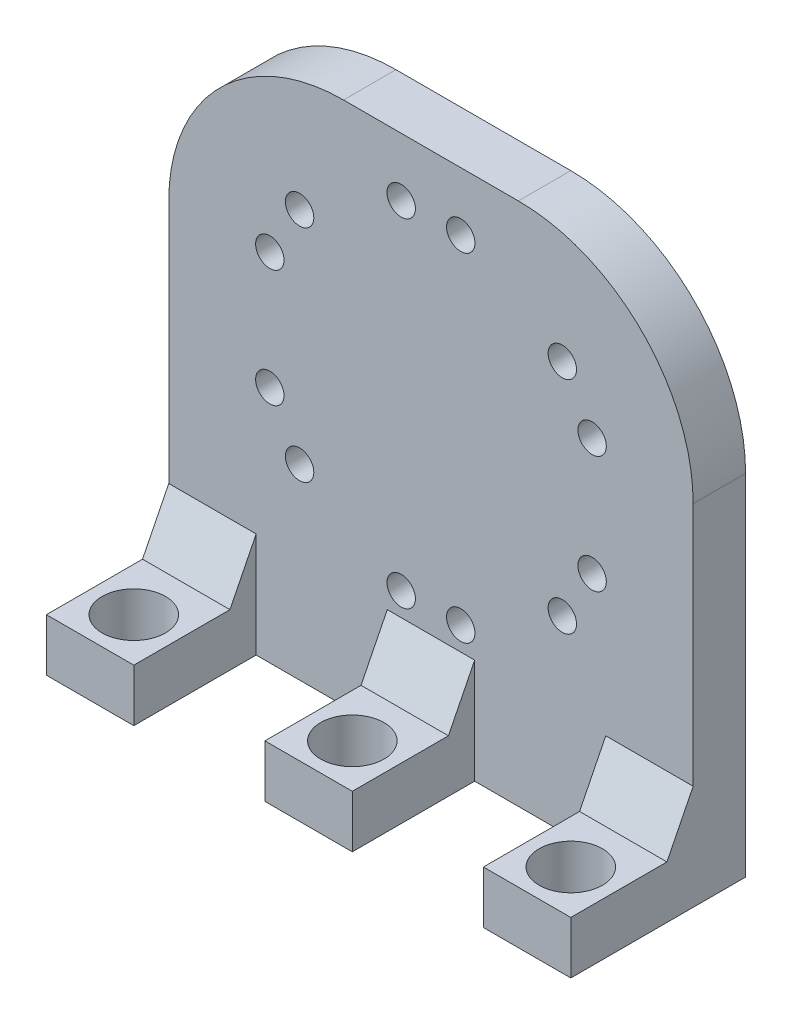
ISO-10303-21;
HEADER;
FILE_DESCRIPTION(('STEP AP214'),'2;1');
FILE_NAME('part.step','',(''),(''),'','','');
FILE_SCHEMA(('AUTOMOTIVE_DESIGN { 1 0 10303 214 1 1 1 1 }'));
ENDSEC;
DATA;
#1=APPLICATION_CONTEXT('core data for automotive mechanical design processes');
#2=APPLICATION_PROTOCOL_DEFINITION('international standard','automotive_design',2000,#1);
#3=PRODUCT_CONTEXT('',#1,'mechanical');
#4=PRODUCT('Part','Part','',(#3));
#5=PRODUCT_RELATED_PRODUCT_CATEGORY('part','',(#4));
#6=PRODUCT_DEFINITION_FORMATION('','',#4);
#7=PRODUCT_DEFINITION_CONTEXT('part definition',#1,'design');
#8=PRODUCT_DEFINITION('design','',#6,#7);
#9=PRODUCT_DEFINITION_SHAPE('','',#8);
#10=(LENGTH_UNIT() NAMED_UNIT(*) SI_UNIT(.MILLI.,.METRE.));
#11=(NAMED_UNIT(*) PLANE_ANGLE_UNIT() SI_UNIT($,.RADIAN.));
#12=(NAMED_UNIT(*) SI_UNIT($,.STERADIAN.) SOLID_ANGLE_UNIT());
#13=UNCERTAINTY_MEASURE_WITH_UNIT(LENGTH_MEASURE(1.E-05),#10,'distance_accuracy_value','');
#14=(GEOMETRIC_REPRESENTATION_CONTEXT(3) GLOBAL_UNCERTAINTY_ASSIGNED_CONTEXT((#13)) GLOBAL_UNIT_ASSIGNED_CONTEXT((#10,
#11,#12)) REPRESENTATION_CONTEXT('',''));
#15=CARTESIAN_POINT('',(0.,0.,0.));
#16=DIRECTION('',(0.,0.,1.));
#17=DIRECTION('',(1.,0.,0.));
#18=AXIS2_PLACEMENT_3D('',#15,#16,#17);
#19=CARTESIAN_POINT('',(0.,0.,6.));
#20=DIRECTION('',(0.,0.,1.));
#21=DIRECTION('',(1.,0.,0.));
#22=AXIS2_PLACEMENT_3D('',#19,#20,#21);
#23=PLANE('',#22);
#24=CARTESIAN_POINT('',(-3.40697724582519,-15.3219281140995,6.));
#25=DIRECTION('',(0.,0.,1.));
#26=DIRECTION('',(1.,0.,0.));
#27=AXIS2_PLACEMENT_3D('',#24,#25,#26);
#28=CIRCLE('',#27,1.625);
#29=CARTESIAN_POINT('',(-1.78197724582519,-15.3219281140995,6.));
#30=VERTEX_POINT('',#29);
#31=EDGE_CURVE('E797',#30,#30,#28,.T.);
#32=ORIENTED_EDGE('',*,*,#31,.F.);
#33=EDGE_LOOP('',(#32));
#34=FACE_BOUND('',#33,.T.);
#35=CARTESIAN_POINT('',(18.4367692198196,-2.71043521204944,6.));
#36=DIRECTION('',(0.,0.,1.));
#37=DIRECTION('',(1.,0.,0.));
#38=AXIS2_PLACEMENT_3D('',#35,#36,#37);
#39=CIRCLE('',#38,1.625);
#40=CARTESIAN_POINT('',(20.0617692198196,-2.71043521204944,6.));
#41=VERTEX_POINT('',#40);
#42=EDGE_CURVE('E794',#41,#41,#39,.T.);
#43=ORIENTED_EDGE('',*,*,#42,.F.);
#44=EDGE_LOOP('',(#43));
#45=FACE_BOUND('',#44,.T.);
#46=CARTESIAN_POINT('',(15.0297919739945,-8.61149290204977,6.));
#47=DIRECTION('',(0.,0.,1.));
#48=DIRECTION('',(1.,0.,0.));
#49=AXIS2_PLACEMENT_3D('',#46,#47,#48);
#50=CIRCLE('',#49,1.625);
#51=CARTESIAN_POINT('',(16.6547919739944,-8.61149290204977,6.));
#52=VERTEX_POINT('',#51);
#53=EDGE_CURVE('E744',#52,#52,#50,.T.);
#54=ORIENTED_EDGE('',*,*,#53,.F.);
#55=EDGE_LOOP('',(#54));
#56=FACE_BOUND('',#55,.T.);
#57=CARTESIAN_POINT('',(15.0297919739942,16.6114929020501,6.));
#58=DIRECTION('',(0.,0.,1.));
#59=DIRECTION('',(1.,0.,0.));
#60=AXIS2_PLACEMENT_3D('',#57,#58,#59);
#61=CIRCLE('',#60,1.625);
#62=CARTESIAN_POINT('',(16.6547919739942,16.6114929020501,6.));
#63=VERTEX_POINT('',#62);
#64=EDGE_CURVE('E790',#63,#63,#61,.T.);
#65=ORIENTED_EDGE('',*,*,#64,.F.);
#66=EDGE_LOOP('',(#65));
#67=FACE_BOUND('',#66,.T.);
#68=CARTESIAN_POINT('',(18.4367692198194,10.7104352120498,6.));
#69=DIRECTION('',(0.,0.,1.));
#70=DIRECTION('',(1.,0.,0.));
#71=AXIS2_PLACEMENT_3D('',#68,#69,#70);
#72=CIRCLE('',#71,1.625);
#73=CARTESIAN_POINT('',(20.0617692198194,10.7104352120498,6.));
#74=VERTEX_POINT('',#73);
#75=EDGE_CURVE('E787',#74,#74,#72,.T.);
#76=ORIENTED_EDGE('',*,*,#75,.F.);
#77=EDGE_LOOP('',(#76));
#78=FACE_BOUND('',#77,.T.);
#79=CARTESIAN_POINT('',(-15.0297919739944,16.6114929020499,6.));
#80=DIRECTION('',(0.,0.,1.));
#81=DIRECTION('',(1.,0.,0.));
#82=AXIS2_PLACEMENT_3D('',#79,#80,#81);
#83=CIRCLE('',#82,1.625);
#84=CARTESIAN_POINT('',(-13.4047919739944,16.6114929020499,6.));
#85=VERTEX_POINT('',#84);
#86=EDGE_CURVE('E784',#85,#85,#83,.T.);
#87=ORIENTED_EDGE('',*,*,#86,.F.);
#88=EDGE_LOOP('',(#87));
#89=FACE_BOUND('',#88,.T.);
#90=CARTESIAN_POINT('',(-15.0297919739943,-8.61149290204997,6.));
#91=DIRECTION('',(0.,0.,1.));
#92=DIRECTION('',(1.,0.,0.));
#93=AXIS2_PLACEMENT_3D('',#90,#91,#92);
#94=CIRCLE('',#93,1.625);
#95=CARTESIAN_POINT('',(-13.4047919739943,-8.61149290204997,6.));
#96=VERTEX_POINT('',#95);
#97=EDGE_CURVE('E781',#96,#96,#94,.T.);
#98=ORIENTED_EDGE('',*,*,#97,.F.);
#99=EDGE_LOOP('',(#98));
#100=FACE_BOUND('',#99,.T.);
#101=CARTESIAN_POINT('',(-18.4367692198195,-2.71043521204968,6.));
#102=DIRECTION('',(0.,0.,1.));
#103=DIRECTION('',(1.,0.,0.));
#104=AXIS2_PLACEMENT_3D('',#101,#102,#103);
#105=CIRCLE('',#104,1.625);
#106=CARTESIAN_POINT('',(-16.8117692198195,-2.71043521204968,6.));
#107=VERTEX_POINT('',#106);
#108=EDGE_CURVE('E778',#107,#107,#105,.T.);
#109=ORIENTED_EDGE('',*,*,#108,.F.);
#110=EDGE_LOOP('',(#109));
#111=FACE_BOUND('',#110,.T.);
#112=CARTESIAN_POINT('',(3.40697724582518,-15.3219281140995,6.));
#113=DIRECTION('',(0.,0.,1.));
#114=DIRECTION('',(1.,0.,0.));
#115=AXIS2_PLACEMENT_3D('',#112,#113,#114);
#116=CIRCLE('',#115,1.625);
#117=CARTESIAN_POINT('',(5.03197724582518,-15.3219281140995,6.));
#118=VERTEX_POINT('',#117);
#119=EDGE_CURVE('E773',#118,#118,#116,.T.);
#120=ORIENTED_EDGE('',*,*,#119,.F.);
#121=EDGE_LOOP('',(#120));
#122=FACE_BOUND('',#121,.T.);
#123=CARTESIAN_POINT('',(-18.4367692198195,10.7104352120496,6.));
#124=DIRECTION('',(0.,0.,1.));
#125=DIRECTION('',(1.,0.,0.));
#126=AXIS2_PLACEMENT_3D('',#123,#124,#125);
#127=CIRCLE('',#126,1.625);
#128=CARTESIAN_POINT('',(-16.8117692198195,10.7104352120496,6.));
#129=VERTEX_POINT('',#128);
#130=EDGE_CURVE('E802',#129,#129,#127,.T.);
#131=ORIENTED_EDGE('',*,*,#130,.F.);
#132=EDGE_LOOP('',(#131));
#133=FACE_BOUND('',#132,.T.);
#134=CARTESIAN_POINT('',(3.40697724582519,23.3219281140995,6.));
#135=DIRECTION('',(0.,0.,1.));
#136=DIRECTION('',(1.,0.,0.));
#137=AXIS2_PLACEMENT_3D('',#134,#135,#136);
#138=CIRCLE('',#137,1.625);
#139=CARTESIAN_POINT('',(5.03197724582519,23.3219281140995,6.));
#140=VERTEX_POINT('',#139);
#141=EDGE_CURVE('E808',#140,#140,#138,.T.);
#142=ORIENTED_EDGE('',*,*,#141,.F.);
#143=EDGE_LOOP('',(#142));
#144=FACE_BOUND('',#143,.T.);
#145=CARTESIAN_POINT('',(-3.40697724582518,23.3219281140995,6.));
#146=DIRECTION('',(0.,0.,1.));
#147=DIRECTION('',(1.,0.,0.));
#148=AXIS2_PLACEMENT_3D('',#145,#146,#147);
#149=CIRCLE('',#148,1.625);
#150=CARTESIAN_POINT('',(-1.78197724582518,23.3219281140995,6.));
#151=VERTEX_POINT('',#150);
#152=EDGE_CURVE('E814',#151,#151,#149,.T.);
#153=ORIENTED_EDGE('',*,*,#152,.F.);
#154=EDGE_LOOP('',(#153));
#155=FACE_BOUND('',#154,.T.);
#156=DIRECTION('',(-1.,0.,0.));
#157=VECTOR('',#156,1.);
#158=CARTESIAN_POINT('',(-30.,30.,6.));
#159=LINE('',#158,#157);
#160=CARTESIAN_POINT('',(9.99999999999999,30.,6.));
#161=VERTEX_POINT('',#160);
#162=CARTESIAN_POINT('',(-10.,30.,6.));
#163=VERTEX_POINT('',#162);
#164=EDGE_CURVE('E297',#161,#163,#159,.T.);
#165=ORIENTED_EDGE('',*,*,#164,.T.);
#166=CARTESIAN_POINT('',(-10.,9.99999999999999,6.));
#167=DIRECTION('',(0.,0.,1.));
#168=DIRECTION('',(1.,0.,0.));
#169=AXIS2_PLACEMENT_3D('',#166,#167,#168);
#170=CIRCLE('',#169,20.);
#171=CARTESIAN_POINT('',(-30.,9.99999999999999,6.));
#172=VERTEX_POINT('',#171);
#173=EDGE_CURVE('E43',#163,#172,#170,.T.);
#174=ORIENTED_EDGE('',*,*,#173,.T.);
#175=DIRECTION('',(0.,-1.,0.));
#176=VECTOR('',#175,1.);
#177=CARTESIAN_POINT('',(-30.,30.,6.));
#178=LINE('',#177,#176);
#179=CARTESIAN_POINT('',(-30.,-18.,6.));
#180=VERTEX_POINT('',#179);
#181=EDGE_CURVE('E190',#172,#180,#178,.T.);
#182=ORIENTED_EDGE('',*,*,#181,.T.);
#183=DIRECTION('',(1.,0.,0.));
#184=VECTOR('',#183,1.);
#185=CARTESIAN_POINT('',(-66.7082039324994,-18.,6.));
#186=LINE('',#185,#184);
#187=CARTESIAN_POINT('',(-20.,-18.,6.));
#188=VERTEX_POINT('',#187);
#189=EDGE_CURVE('E184',#180,#188,#186,.T.);
#190=ORIENTED_EDGE('',*,*,#189,.T.);
#191=DIRECTION('',(0.,-1.,0.));
#192=VECTOR('',#191,1.);
#193=CARTESIAN_POINT('',(-20.,-24.,6.));
#194=LINE('',#193,#192);
#195=CARTESIAN_POINT('',(-20.,-30.,6.));
#196=VERTEX_POINT('',#195);
#197=EDGE_CURVE('E169',#188,#196,#194,.T.);
#198=ORIENTED_EDGE('',*,*,#197,.T.);
#199=DIRECTION('',(1.,0.,0.));
#200=VECTOR('',#199,1.);
#201=CARTESIAN_POINT('',(-30.,-30.,6.));
#202=LINE('',#201,#200);
#203=CARTESIAN_POINT('',(-5.,-30.,6.));
#204=VERTEX_POINT('',#203);
#205=EDGE_CURVE('E293',#196,#204,#202,.T.);
#206=ORIENTED_EDGE('',*,*,#205,.T.);
#207=DIRECTION('',(0.,-1.,0.));
#208=VECTOR('',#207,1.);
#209=CARTESIAN_POINT('',(-5.,-24.,6.));
#210=LINE('',#209,#208);
#211=CARTESIAN_POINT('',(-5.,-18.,6.));
#212=VERTEX_POINT('',#211);
#213=EDGE_CURVE('E227',#212,#204,#210,.T.);
#214=ORIENTED_EDGE('',*,*,#213,.F.);
#215=DIRECTION('',(1.,0.,0.));
#216=VECTOR('',#215,1.);
#217=CARTESIAN_POINT('',(-16.7082039324994,-18.,6.));
#218=LINE('',#217,#216);
#219=CARTESIAN_POINT('',(5.,-18.,6.));
#220=VERTEX_POINT('',#219);
#221=EDGE_CURVE('E200',#212,#220,#218,.T.);
#222=ORIENTED_EDGE('',*,*,#221,.T.);
#223=DIRECTION('',(0.,-1.,0.));
#224=VECTOR('',#223,1.);
#225=CARTESIAN_POINT('',(5.,-24.,6.));
#226=LINE('',#225,#224);
#227=CARTESIAN_POINT('',(5.,-30.,6.));
#228=VERTEX_POINT('',#227);
#229=EDGE_CURVE('E218',#220,#228,#226,.T.);
#230=ORIENTED_EDGE('',*,*,#229,.T.);
#231=CARTESIAN_POINT('',(20.,-30.,6.));
#232=VERTEX_POINT('',#231);
#233=EDGE_CURVE('E291',#228,#232,#202,.T.);
#234=ORIENTED_EDGE('',*,*,#233,.T.);
#235=DIRECTION('',(0.,-1.,0.));
#236=VECTOR('',#235,1.);
#237=CARTESIAN_POINT('',(20.,-24.,6.));
#238=LINE('',#237,#236);
#239=CARTESIAN_POINT('',(20.,-18.,6.));
#240=VERTEX_POINT('',#239);
#241=EDGE_CURVE('E267',#240,#232,#238,.T.);
#242=ORIENTED_EDGE('',*,*,#241,.F.);
#243=DIRECTION('',(1.,0.,0.));
#244=VECTOR('',#243,1.);
#245=CARTESIAN_POINT('',(13.2917960675006,-18.,6.));
#246=LINE('',#245,#244);
#247=CARTESIAN_POINT('',(30.,-18.,6.));
#248=VERTEX_POINT('',#247);
#249=EDGE_CURVE('E259',#240,#248,#246,.T.);
#250=ORIENTED_EDGE('',*,*,#249,.T.);
#251=DIRECTION('',(0.,1.,0.));
#252=VECTOR('',#251,1.);
#253=CARTESIAN_POINT('',(30.,30.,6.));
#254=LINE('',#253,#252);
#255=CARTESIAN_POINT('',(30.,9.99999999999999,6.));
#256=VERTEX_POINT('',#255);
#257=EDGE_CURVE('E295',#248,#256,#254,.T.);
#258=ORIENTED_EDGE('',*,*,#257,.T.);
#259=CARTESIAN_POINT('',(9.99999999999999,9.99999999999999,6.));
#260=DIRECTION('',(0.,0.,1.));
#261=DIRECTION('',(1.,0.,0.));
#262=AXIS2_PLACEMENT_3D('',#259,#260,#261);
#263=CIRCLE('',#262,20.);
#264=EDGE_CURVE('E322',#256,#161,#263,.T.);
#265=ORIENTED_EDGE('',*,*,#264,.T.);
#266=EDGE_LOOP('',(#165,#174,#182,#190,#198,#206,#214,#222,#230,#234,#242,#250,#258,#265));
#267=FACE_BOUND('',#266,.T.);
#268=ADVANCED_FACE('F35',(#34,#45,#56,#67,#78,#89,#100,#111,#122,#133,#144,#155,#267),#23,.T.);
#269=CARTESIAN_POINT('',(-30.,30.,6.));
#270=DIRECTION('',(1.,0.,0.));
#271=DIRECTION('',(0.,1.,0.));
#272=AXIS2_PLACEMENT_3D('',#269,#270,#271);
#273=PLANE('',#272);
#274=ORIENTED_EDGE('',*,*,#181,.F.);
#275=DIRECTION('',(0.,0.,-1.));
#276=VECTOR('',#275,1.);
#277=CARTESIAN_POINT('',(-30.,9.99999999999999,6.));
#278=LINE('',#277,#276);
#279=CARTESIAN_POINT('',(-30.,9.99999999999999,0.));
#280=VERTEX_POINT('',#279);
#281=EDGE_CURVE('E311',#172,#280,#278,.T.);
#282=ORIENTED_EDGE('',*,*,#281,.T.);
#283=DIRECTION('',(0.,-1.,0.));
#284=VECTOR('',#283,1.);
#285=CARTESIAN_POINT('',(-30.,30.,0.));
#286=LINE('',#285,#284);
#287=CARTESIAN_POINT('',(-30.,-30.,0.));
#288=VERTEX_POINT('',#287);
#289=EDGE_CURVE('E284',#280,#288,#286,.T.);
#290=ORIENTED_EDGE('',*,*,#289,.T.);
#291=DIRECTION('',(0.,0.,-1.));
#292=VECTOR('',#291,1.);
#293=CARTESIAN_POINT('',(-30.,-30.,6.));
#294=LINE('',#293,#292);
#295=CARTESIAN_POINT('',(-30.,-30.,20.));
#296=VERTEX_POINT('',#295);
#297=EDGE_CURVE('E308',#296,#288,#294,.T.);
#298=ORIENTED_EDGE('',*,*,#297,.F.);
#299=DIRECTION('',(0.,-1.,0.));
#300=VECTOR('',#299,1.);
#301=CARTESIAN_POINT('',(-30.,-24.,20.));
#302=LINE('',#301,#300);
#303=CARTESIAN_POINT('',(-30.,-24.,20.));
#304=VERTEX_POINT('',#303);
#305=EDGE_CURVE('E211',#304,#296,#302,.T.);
#306=ORIENTED_EDGE('',*,*,#305,.F.);
#307=DIRECTION('',(0.,0.,-1.));
#308=VECTOR('',#307,1.);
#309=CARTESIAN_POINT('',(-30.,-24.,20.));
#310=LINE('',#309,#308);
#311=CARTESIAN_POINT('',(-30.,-24.,9.));
#312=VERTEX_POINT('',#311);
#313=EDGE_CURVE('E219',#304,#312,#310,.T.);
#314=ORIENTED_EDGE('',*,*,#313,.T.);
#315=DIRECTION('',(0.,0.894427190999916,-0.447213595499958));
#316=VECTOR('',#315,1.);
#317=CARTESIAN_POINT('',(-30.,-18.,6.));
#318=LINE('',#317,#316);
#319=EDGE_CURVE('E193',#312,#180,#318,.T.);
#320=ORIENTED_EDGE('',*,*,#319,.T.);
#321=EDGE_LOOP('',(#274,#282,#290,#298,#306,#314,#320));
#322=FACE_BOUND('',#321,.T.);
#323=ADVANCED_FACE('F327',(#322),#273,.F.);
#324=CARTESIAN_POINT('',(-30.,-30.,6.));
#325=DIRECTION('',(0.,1.,0.));
#326=DIRECTION('',(0.,0.,1.));
#327=AXIS2_PLACEMENT_3D('',#324,#325,#326);
#328=PLANE('',#327);
#329=CARTESIAN_POINT('',(-25.,-30.,15.));
#330=DIRECTION('',(0.,1.,0.));
#331=DIRECTION('',(0.,0.,1.));
#332=AXIS2_PLACEMENT_3D('',#329,#330,#331);
#333=CIRCLE('',#332,3.625);
#334=CARTESIAN_POINT('',(-25.,-30.,18.625));
#335=VERTEX_POINT('',#334);
#336=EDGE_CURVE('E820',#335,#335,#333,.T.);
#337=ORIENTED_EDGE('',*,*,#336,.T.);
#338=EDGE_LOOP('',(#337));
#339=FACE_BOUND('',#338,.T.);
#340=CARTESIAN_POINT('',(0.,-30.,15.));
#341=DIRECTION('',(0.,1.,0.));
#342=DIRECTION('',(0.,0.,1.));
#343=AXIS2_PLACEMENT_3D('',#340,#341,#342);
#344=CIRCLE('',#343,3.625);
#345=CARTESIAN_POINT('',(0.,-30.,18.625));
#346=VERTEX_POINT('',#345);
#347=EDGE_CURVE('E187',#346,#346,#344,.T.);
#348=ORIENTED_EDGE('',*,*,#347,.T.);
#349=EDGE_LOOP('',(#348));
#350=FACE_BOUND('',#349,.T.);
#351=CARTESIAN_POINT('',(25.,-30.,15.));
#352=DIRECTION('',(0.,1.,0.));
#353=DIRECTION('',(0.,0.,1.));
#354=AXIS2_PLACEMENT_3D('',#351,#352,#353);
#355=CIRCLE('',#354,3.625);
#356=CARTESIAN_POINT('',(25.,-30.,18.625));
#357=VERTEX_POINT('',#356);
#358=EDGE_CURVE('E253',#357,#357,#355,.T.);
#359=ORIENTED_EDGE('',*,*,#358,.T.);
#360=EDGE_LOOP('',(#359));
#361=FACE_BOUND('',#360,.T.);
#362=DIRECTION('',(1.,0.,0.));
#363=VECTOR('',#362,1.);
#364=CARTESIAN_POINT('',(-30.,-30.,0.));
#365=LINE('',#364,#363);
#366=CARTESIAN_POINT('',(30.,-30.,0.));
#367=VERTEX_POINT('',#366);
#368=EDGE_CURVE('E301',#288,#367,#365,.T.);
#369=ORIENTED_EDGE('',*,*,#368,.T.);
#370=DIRECTION('',(0.,0.,-1.));
#371=VECTOR('',#370,1.);
#372=CARTESIAN_POINT('',(30.,-30.,6.));
#373=LINE('',#372,#371);
#374=CARTESIAN_POINT('',(30.,-30.,20.));
#375=VERTEX_POINT('',#374);
#376=EDGE_CURVE('E299',#375,#367,#373,.T.);
#377=ORIENTED_EDGE('',*,*,#376,.F.);
#378=DIRECTION('',(-1.,0.,0.));
#379=VECTOR('',#378,1.);
#380=CARTESIAN_POINT('',(30.,-30.,20.));
#381=LINE('',#380,#379);
#382=CARTESIAN_POINT('',(20.,-30.,20.));
#383=VERTEX_POINT('',#382);
#384=EDGE_CURVE('E271',#375,#383,#381,.T.);
#385=ORIENTED_EDGE('',*,*,#384,.T.);
#386=DIRECTION('',(0.,0.,-1.));
#387=VECTOR('',#386,1.);
#388=CARTESIAN_POINT('',(20.,-30.,20.));
#389=LINE('',#388,#387);
#390=EDGE_CURVE('E278',#383,#232,#389,.T.);
#391=ORIENTED_EDGE('',*,*,#390,.T.);
#392=ORIENTED_EDGE('',*,*,#233,.F.);
#393=DIRECTION('',(0.,0.,-1.));
#394=VECTOR('',#393,1.);
#395=CARTESIAN_POINT('',(5.,-30.,20.));
#396=LINE('',#395,#394);
#397=CARTESIAN_POINT('',(5.,-30.,20.));
#398=VERTEX_POINT('',#397);
#399=EDGE_CURVE('E234',#398,#228,#396,.T.);
#400=ORIENTED_EDGE('',*,*,#399,.F.);
#401=DIRECTION('',(-1.,0.,0.));
#402=VECTOR('',#401,1.);
#403=CARTESIAN_POINT('',(5.,-30.,20.));
#404=LINE('',#403,#402);
#405=CARTESIAN_POINT('',(-5.,-30.,20.));
#406=VERTEX_POINT('',#405);
#407=EDGE_CURVE('E226',#398,#406,#404,.T.);
#408=ORIENTED_EDGE('',*,*,#407,.T.);
#409=DIRECTION('',(0.,0.,-1.));
#410=VECTOR('',#409,1.);
#411=CARTESIAN_POINT('',(-5.,-30.,20.));
#412=LINE('',#411,#410);
#413=EDGE_CURVE('E246',#406,#204,#412,.T.);
#414=ORIENTED_EDGE('',*,*,#413,.T.);
#415=ORIENTED_EDGE('',*,*,#205,.F.);
#416=DIRECTION('',(0.,0.,-1.));
#417=VECTOR('',#416,1.);
#418=CARTESIAN_POINT('',(-20.,-30.,20.));
#419=LINE('',#418,#417);
#420=CARTESIAN_POINT('',(-20.,-30.,20.));
#421=VERTEX_POINT('',#420);
#422=EDGE_CURVE('E175',#421,#196,#419,.T.);
#423=ORIENTED_EDGE('',*,*,#422,.F.);
#424=DIRECTION('',(-1.,0.,0.));
#425=VECTOR('',#424,1.);
#426=CARTESIAN_POINT('',(-20.,-30.,20.));
#427=LINE('',#426,#425);
#428=EDGE_CURVE('E208',#421,#296,#427,.T.);
#429=ORIENTED_EDGE('',*,*,#428,.T.);
#430=ORIENTED_EDGE('',*,*,#297,.T.);
#431=EDGE_LOOP('',(#369,#377,#385,#391,#392,#400,#408,#414,#415,#423,#429,#430));
#432=FACE_BOUND('',#431,.T.);
#433=ADVANCED_FACE('F343',(#339,#350,#361,#432),#328,.F.);
#434=CARTESIAN_POINT('',(30.,30.,6.));
#435=DIRECTION('',(-1.,0.,0.));
#436=DIRECTION('',(0.,-1.,0.));
#437=AXIS2_PLACEMENT_3D('',#434,#435,#436);
#438=PLANE('',#437);
#439=DIRECTION('',(0.,1.,0.));
#440=VECTOR('',#439,1.);
#441=CARTESIAN_POINT('',(30.,30.,0.));
#442=LINE('',#441,#440);
#443=CARTESIAN_POINT('',(30.,9.99999999999999,0.));
#444=VERTEX_POINT('',#443);
#445=EDGE_CURVE('E303',#367,#444,#442,.T.);
#446=ORIENTED_EDGE('',*,*,#445,.T.);
#447=DIRECTION('',(0.,0.,-1.));
#448=VECTOR('',#447,1.);
#449=CARTESIAN_POINT('',(30.,9.99999999999999,6.));
#450=LINE('',#449,#448);
#451=EDGE_CURVE('E11',#444,#256,#450,.F.);
#452=ORIENTED_EDGE('',*,*,#451,.T.);
#453=ORIENTED_EDGE('',*,*,#257,.F.);
#454=DIRECTION('',(0.,-0.894427190999916,0.447213595499958));
#455=VECTOR('',#454,1.);
#456=CARTESIAN_POINT('',(30.,-18.,6.));
#457=LINE('',#456,#455);
#458=CARTESIAN_POINT('',(30.,-24.,9.));
#459=VERTEX_POINT('',#458);
#460=EDGE_CURVE('E256',#248,#459,#457,.T.);
#461=ORIENTED_EDGE('',*,*,#460,.T.);
#462=DIRECTION('',(0.,0.,-1.));
#463=VECTOR('',#462,1.);
#464=CARTESIAN_POINT('',(30.,-24.,20.));
#465=LINE('',#464,#463);
#466=CARTESIAN_POINT('',(30.,-24.,20.));
#467=VERTEX_POINT('',#466);
#468=EDGE_CURVE('E281',#467,#459,#465,.T.);
#469=ORIENTED_EDGE('',*,*,#468,.F.);
#470=DIRECTION('',(0.,-1.,0.));
#471=VECTOR('',#470,1.);
#472=CARTESIAN_POINT('',(30.,-24.,20.));
#473=LINE('',#472,#471);
#474=EDGE_CURVE('E268',#467,#375,#473,.T.);
#475=ORIENTED_EDGE('',*,*,#474,.T.);
#476=ORIENTED_EDGE('',*,*,#376,.T.);
#477=EDGE_LOOP('',(#446,#452,#453,#461,#469,#475,#476));
#478=FACE_BOUND('',#477,.T.);
#479=ADVANCED_FACE('F339',(#478),#438,.F.);
#480=CARTESIAN_POINT('',(-30.,30.,6.));
#481=DIRECTION('',(0.,-1.,0.));
#482=DIRECTION('',(1.,0.,0.));
#483=AXIS2_PLACEMENT_3D('',#480,#481,#482);
#484=PLANE('',#483);
#485=DIRECTION('',(-1.,0.,0.));
#486=VECTOR('',#485,1.);
#487=CARTESIAN_POINT('',(-30.,30.,0.));
#488=LINE('',#487,#486);
#489=CARTESIAN_POINT('',(9.99999999999999,30.,0.));
#490=VERTEX_POINT('',#489);
#491=CARTESIAN_POINT('',(-10.,30.,0.));
#492=VERTEX_POINT('',#491);
#493=EDGE_CURVE('E292',#490,#492,#488,.T.);
#494=ORIENTED_EDGE('',*,*,#493,.T.);
#495=DIRECTION('',(0.,0.,-1.));
#496=VECTOR('',#495,1.);
#497=CARTESIAN_POINT('',(-10.,30.,6.));
#498=LINE('',#497,#496);
#499=EDGE_CURVE('E56',#492,#163,#498,.F.);
#500=ORIENTED_EDGE('',*,*,#499,.T.);
#501=ORIENTED_EDGE('',*,*,#164,.F.);
#502=DIRECTION('',(0.,0.,-1.));
#503=VECTOR('',#502,1.);
#504=CARTESIAN_POINT('',(9.99999999999999,30.,6.));
#505=LINE('',#504,#503);
#506=EDGE_CURVE('E318',#161,#490,#505,.T.);
#507=ORIENTED_EDGE('',*,*,#506,.T.);
#508=EDGE_LOOP('',(#494,#500,#501,#507));
#509=FACE_BOUND('',#508,.T.);
#510=ADVANCED_FACE('F334',(#509),#484,.F.);
#511=CARTESIAN_POINT('',(0.,0.,0.));
#512=DIRECTION('',(0.,0.,1.));
#513=DIRECTION('',(1.,0.,0.));
#514=AXIS2_PLACEMENT_3D('',#511,#512,#513);
#515=PLANE('',#514);
#516=CARTESIAN_POINT('',(-3.40697724582519,-15.3219281140995,0.));
#517=DIRECTION('',(0.,0.,-1.));
#518=DIRECTION('',(1.,0.,0.));
#519=AXIS2_PLACEMENT_3D('',#516,#517,#518);
#520=CIRCLE('',#519,1.625);
#521=CARTESIAN_POINT('',(-1.78197724582519,-15.3219281140995,0.));
#522=VERTEX_POINT('',#521);
#523=EDGE_CURVE('E753',#522,#522,#520,.T.);
#524=ORIENTED_EDGE('',*,*,#523,.F.);
#525=EDGE_LOOP('',(#524));
#526=FACE_BOUND('',#525,.T.);
#527=CARTESIAN_POINT('',(18.4367692198196,-2.71043521204944,0.));
#528=DIRECTION('',(0.,0.,-1.));
#529=DIRECTION('',(0.499999999999992,0.866025403784443,0.));
#530=AXIS2_PLACEMENT_3D('',#527,#528,#529);
#531=CIRCLE('',#530,1.625);
#532=CARTESIAN_POINT('',(19.2492692198196,-1.30314393089972,0.));
#533=VERTEX_POINT('',#532);
#534=EDGE_CURVE('E749',#533,#533,#531,.T.);
#535=ORIENTED_EDGE('',*,*,#534,.F.);
#536=EDGE_LOOP('',(#535));
#537=FACE_BOUND('',#536,.T.);
#538=CARTESIAN_POINT('',(15.0297919739945,-8.61149290204977,0.));
#539=DIRECTION('',(0.,0.,-1.));
#540=DIRECTION('',(0.499999999999992,0.866025403784443,0.));
#541=AXIS2_PLACEMENT_3D('',#538,#539,#540);
#542=CIRCLE('',#541,1.625);
#543=CARTESIAN_POINT('',(15.8422919739944,-7.20420162090005,0.));
#544=VERTEX_POINT('',#543);
#545=EDGE_CURVE('E747',#544,#544,#542,.T.);
#546=ORIENTED_EDGE('',*,*,#545,.F.);
#547=EDGE_LOOP('',(#546));
#548=FACE_BOUND('',#547,.T.);
#549=CARTESIAN_POINT('',(15.0297919739942,16.6114929020501,0.));
#550=DIRECTION('',(0.,0.,-1.));
#551=DIRECTION('',(-0.50000000000001,0.866025403784433,0.));
#552=AXIS2_PLACEMENT_3D('',#549,#550,#551);
#553=CIRCLE('',#552,1.625);
#554=CARTESIAN_POINT('',(14.2172919739942,18.0187841831998,0.));
#555=VERTEX_POINT('',#554);
#556=EDGE_CURVE('E750',#555,#555,#553,.T.);
#557=ORIENTED_EDGE('',*,*,#556,.F.);
#558=EDGE_LOOP('',(#557));
#559=FACE_BOUND('',#558,.T.);
#560=CARTESIAN_POINT('',(18.4367692198194,10.7104352120498,0.));
#561=DIRECTION('',(0.,0.,-1.));
#562=DIRECTION('',(-0.50000000000001,0.866025403784433,0.));
#563=AXIS2_PLACEMENT_3D('',#560,#561,#562);
#564=CIRCLE('',#563,1.625);
#565=CARTESIAN_POINT('',(17.6242692198194,12.1177264931995,0.));
#566=VERTEX_POINT('',#565);
#567=EDGE_CURVE('E756',#566,#566,#564,.T.);
#568=ORIENTED_EDGE('',*,*,#567,.F.);
#569=EDGE_LOOP('',(#568));
#570=FACE_BOUND('',#569,.T.);
#571=CARTESIAN_POINT('',(-15.0297919739944,16.6114929020499,0.));
#572=DIRECTION('',(0.,0.,-1.));
#573=DIRECTION('',(-0.499999999999998,-0.86602540378444,0.));
#574=AXIS2_PLACEMENT_3D('',#571,#572,#573);
#575=CIRCLE('',#574,1.625);
#576=CARTESIAN_POINT('',(-15.8422919739944,15.2042016209002,0.));
#577=VERTEX_POINT('',#576);
#578=EDGE_CURVE('E770',#577,#577,#575,.T.);
#579=ORIENTED_EDGE('',*,*,#578,.F.);
#580=EDGE_LOOP('',(#579));
#581=FACE_BOUND('',#580,.T.);
#582=CARTESIAN_POINT('',(-15.0297919739943,-8.61149290204997,0.));
#583=DIRECTION('',(0.,0.,-1.));
#584=DIRECTION('',(0.500000000000004,-0.866025403784436,0.));
#585=AXIS2_PLACEMENT_3D('',#582,#583,#584);
#586=CIRCLE('',#585,1.625);
#587=CARTESIAN_POINT('',(-14.2172919739943,-10.0187841831997,0.));
#588=VERTEX_POINT('',#587);
#589=EDGE_CURVE('E767',#588,#588,#586,.T.);
#590=ORIENTED_EDGE('',*,*,#589,.F.);
#591=EDGE_LOOP('',(#590));
#592=FACE_BOUND('',#591,.T.);
#593=CARTESIAN_POINT('',(-18.4367692198195,-2.71043521204968,0.));
#594=DIRECTION('',(0.,0.,-1.));
#595=DIRECTION('',(0.500000000000004,-0.866025403784436,0.));
#596=AXIS2_PLACEMENT_3D('',#593,#594,#595);
#597=CIRCLE('',#596,1.625);
#598=CARTESIAN_POINT('',(-17.6242692198195,-4.11772649319939,0.));
#599=VERTEX_POINT('',#598);
#600=EDGE_CURVE('E764',#599,#599,#597,.T.);
#601=ORIENTED_EDGE('',*,*,#600,.F.);
#602=EDGE_LOOP('',(#601));
#603=FACE_BOUND('',#602,.T.);
#604=CARTESIAN_POINT('',(3.40697724582518,-15.3219281140995,0.));
#605=DIRECTION('',(0.,0.,-1.));
#606=DIRECTION('',(1.,0.,0.));
#607=AXIS2_PLACEMENT_3D('',#604,#605,#606);
#608=CIRCLE('',#607,1.625);
#609=CARTESIAN_POINT('',(5.03197724582518,-15.3219281140995,0.));
#610=VERTEX_POINT('',#609);
#611=EDGE_CURVE('E762',#610,#610,#608,.T.);
#612=ORIENTED_EDGE('',*,*,#611,.F.);
#613=EDGE_LOOP('',(#612));
#614=FACE_BOUND('',#613,.T.);
#615=CARTESIAN_POINT('',(-18.4367692198195,10.7104352120496,0.));
#616=DIRECTION('',(0.,0.,-1.));
#617=DIRECTION('',(-0.499999999999998,-0.86602540378444,0.));
#618=AXIS2_PLACEMENT_3D('',#615,#616,#617);
#619=CIRCLE('',#618,1.625);
#620=CARTESIAN_POINT('',(-19.2492692198195,9.30314393089986,0.));
#621=VERTEX_POINT('',#620);
#622=EDGE_CURVE('E799',#621,#621,#619,.T.);
#623=ORIENTED_EDGE('',*,*,#622,.F.);
#624=EDGE_LOOP('',(#623));
#625=FACE_BOUND('',#624,.T.);
#626=CARTESIAN_POINT('',(3.40697724582519,23.3219281140995,0.));
#627=DIRECTION('',(0.,0.,-1.));
#628=DIRECTION('',(-1.,0.,0.));
#629=AXIS2_PLACEMENT_3D('',#626,#627,#628);
#630=CIRCLE('',#629,1.625);
#631=CARTESIAN_POINT('',(1.78197724582519,23.3219281140995,0.));
#632=VERTEX_POINT('',#631);
#633=EDGE_CURVE('E805',#632,#632,#630,.T.);
#634=ORIENTED_EDGE('',*,*,#633,.F.);
#635=EDGE_LOOP('',(#634));
#636=FACE_BOUND('',#635,.T.);
#637=CARTESIAN_POINT('',(-3.40697724582518,23.3219281140995,0.));
#638=DIRECTION('',(0.,0.,-1.));
#639=DIRECTION('',(-1.,0.,0.));
#640=AXIS2_PLACEMENT_3D('',#637,#638,#639);
#641=CIRCLE('',#640,1.625);
#642=CARTESIAN_POINT('',(-5.03197724582518,23.3219281140995,0.));
#643=VERTEX_POINT('',#642);
#644=EDGE_CURVE('E811',#643,#643,#641,.T.);
#645=ORIENTED_EDGE('',*,*,#644,.F.);
#646=EDGE_LOOP('',(#645));
#647=FACE_BOUND('',#646,.T.);
#648=ORIENTED_EDGE('',*,*,#289,.F.);
#649=CARTESIAN_POINT('',(-10.,9.99999999999999,0.));
#650=DIRECTION('',(0.,0.,1.));
#651=DIRECTION('',(1.,0.,0.));
#652=AXIS2_PLACEMENT_3D('',#649,#650,#651);
#653=CIRCLE('',#652,20.);
#654=EDGE_CURVE('E316',#280,#492,#653,.F.);
#655=ORIENTED_EDGE('',*,*,#654,.T.);
#656=ORIENTED_EDGE('',*,*,#493,.F.);
#657=CARTESIAN_POINT('',(9.99999999999999,9.99999999999999,0.));
#658=DIRECTION('',(0.,0.,1.));
#659=DIRECTION('',(1.,0.,0.));
#660=AXIS2_PLACEMENT_3D('',#657,#658,#659);
#661=CIRCLE('',#660,20.);
#662=EDGE_CURVE('E314',#490,#444,#661,.F.);
#663=ORIENTED_EDGE('',*,*,#662,.T.);
#664=ORIENTED_EDGE('',*,*,#445,.F.);
#665=ORIENTED_EDGE('',*,*,#368,.F.);
#666=EDGE_LOOP('',(#648,#655,#656,#663,#664,#665));
#667=FACE_BOUND('',#666,.T.);
#668=ADVANCED_FACE('F332',(#526,#537,#548,#559,#570,#581,#592,#603,#614,#625,#636,#647,#667),
#515,.F.);
#669=CARTESIAN_POINT('',(30.,-24.,20.));
#670=DIRECTION('',(0.,-1.,0.));
#671=DIRECTION('',(0.,0.,-1.));
#672=AXIS2_PLACEMENT_3D('',#669,#670,#671);
#673=PLANE('',#672);
#674=CARTESIAN_POINT('',(25.,-24.,15.));
#675=DIRECTION('',(0.,1.,0.));
#676=DIRECTION('',(0.,0.,1.));
#677=AXIS2_PLACEMENT_3D('',#674,#675,#676);
#678=CIRCLE('',#677,3.625);
#679=CARTESIAN_POINT('',(25.,-24.,18.625));
#680=VERTEX_POINT('',#679);
#681=EDGE_CURVE('E242',#680,#680,#678,.T.);
#682=ORIENTED_EDGE('',*,*,#681,.F.);
#683=EDGE_LOOP('',(#682));
#684=FACE_BOUND('',#683,.T.);
#685=ORIENTED_EDGE('',*,*,#468,.T.);
#686=DIRECTION('',(1.,0.,0.));
#687=VECTOR('',#686,1.);
#688=CARTESIAN_POINT('',(13.2917960675006,-24.,9.));
#689=LINE('',#688,#687);
#690=CARTESIAN_POINT('',(20.,-24.,9.));
#691=VERTEX_POINT('',#690);
#692=EDGE_CURVE('E260',#691,#459,#689,.T.);
#693=ORIENTED_EDGE('',*,*,#692,.F.);
#694=DIRECTION('',(0.,0.,-1.));
#695=VECTOR('',#694,1.);
#696=CARTESIAN_POINT('',(20.,-24.,20.));
#697=LINE('',#696,#695);
#698=CARTESIAN_POINT('',(20.,-24.,20.));
#699=VERTEX_POINT('',#698);
#700=EDGE_CURVE('E285',#699,#691,#697,.T.);
#701=ORIENTED_EDGE('',*,*,#700,.F.);
#702=DIRECTION('',(-1.,0.,0.));
#703=VECTOR('',#702,1.);
#704=CARTESIAN_POINT('',(30.,-24.,20.));
#705=LINE('',#704,#703);
#706=EDGE_CURVE('E276',#467,#699,#705,.T.);
#707=ORIENTED_EDGE('',*,*,#706,.F.);
#708=EDGE_LOOP('',(#685,#693,#701,#707));
#709=FACE_BOUND('',#708,.T.);
#710=ADVANCED_FACE('F397',(#684,#709),#673,.F.);
#711=CARTESIAN_POINT('',(20.,-24.,20.));
#712=DIRECTION('',(1.,0.,0.));
#713=DIRECTION('',(0.,0.,-1.));
#714=AXIS2_PLACEMENT_3D('',#711,#712,#713);
#715=PLANE('',#714);
#716=ORIENTED_EDGE('',*,*,#241,.T.);
#717=ORIENTED_EDGE('',*,*,#390,.F.);
#718=DIRECTION('',(0.,-1.,0.));
#719=VECTOR('',#718,1.);
#720=CARTESIAN_POINT('',(20.,-24.,20.));
#721=LINE('',#720,#719);
#722=EDGE_CURVE('E274',#699,#383,#721,.T.);
#723=ORIENTED_EDGE('',*,*,#722,.F.);
#724=ORIENTED_EDGE('',*,*,#700,.T.);
#725=DIRECTION('',(0.,0.894427190999916,-0.447213595499958));
#726=VECTOR('',#725,1.);
#727=CARTESIAN_POINT('',(20.,-18.,6.));
#728=LINE('',#727,#726);
#729=EDGE_CURVE('E262',#691,#240,#728,.T.);
#730=ORIENTED_EDGE('',*,*,#729,.T.);
#731=EDGE_LOOP('',(#716,#717,#723,#724,#730));
#732=FACE_BOUND('',#731,.T.);
#733=ADVANCED_FACE('F351',(#732),#715,.F.);
#734=CARTESIAN_POINT('',(0.,0.,20.));
#735=DIRECTION('',(0.,0.,-1.));
#736=DIRECTION('',(-1.,0.,0.));
#737=AXIS2_PLACEMENT_3D('',#734,#735,#736);
#738=PLANE('',#737);
#739=ORIENTED_EDGE('',*,*,#474,.F.);
#740=ORIENTED_EDGE('',*,*,#706,.T.);
#741=ORIENTED_EDGE('',*,*,#722,.T.);
#742=ORIENTED_EDGE('',*,*,#384,.F.);
#743=EDGE_LOOP('',(#739,#740,#741,#742));
#744=FACE_BOUND('',#743,.T.);
#745=ADVANCED_FACE('F345',(#744),#738,.F.);
#746=CARTESIAN_POINT('',(13.2917960675006,-18.,6.));
#747=DIRECTION('',(0.,0.447213595499958,0.894427190999916));
#748=DIRECTION('',(0.,-0.894427190999916,0.447213595499958));
#749=AXIS2_PLACEMENT_3D('',#746,#747,#748);
#750=PLANE('',#749);
#751=ORIENTED_EDGE('',*,*,#729,.F.);
#752=ORIENTED_EDGE('',*,*,#692,.T.);
#753=ORIENTED_EDGE('',*,*,#460,.F.);
#754=ORIENTED_EDGE('',*,*,#249,.F.);
#755=EDGE_LOOP('',(#751,#752,#753,#754));
#756=FACE_BOUND('',#755,.T.);
#757=ADVANCED_FACE('F629',(#756),#750,.T.);
#758=CARTESIAN_POINT('',(25.,-39.,15.));
#759=DIRECTION('',(0.,1.,0.));
#760=DIRECTION('',(0.,0.,1.));
#761=AXIS2_PLACEMENT_3D('',#758,#759,#760);
#762=CYLINDRICAL_SURFACE('',#761,3.625);
#763=ORIENTED_EDGE('',*,*,#681,.T.);
#764=EDGE_LOOP('',(#763));
#765=FACE_BOUND('',#764,.T.);
#766=ORIENTED_EDGE('',*,*,#358,.F.);
#767=EDGE_LOOP('',(#766));
#768=FACE_BOUND('',#767,.T.);
#769=ADVANCED_FACE('F379',(#765,#768),#762,.F.);
#770=CARTESIAN_POINT('',(5.,-24.,20.));
#771=DIRECTION('',(1.,0.,0.));
#772=DIRECTION('',(0.,0.,-1.));
#773=AXIS2_PLACEMENT_3D('',#770,#771,#772);
#774=PLANE('',#773);
#775=ORIENTED_EDGE('',*,*,#229,.F.);
#776=DIRECTION('',(0.,-0.894427190999916,0.447213595499958));
#777=VECTOR('',#776,1.);
#778=CARTESIAN_POINT('',(5.,-18.,6.));
#779=LINE('',#778,#777);
#780=CARTESIAN_POINT('',(5.,-24.,9.));
#781=VERTEX_POINT('',#780);
#782=EDGE_CURVE('E197',#220,#781,#779,.T.);
#783=ORIENTED_EDGE('',*,*,#782,.T.);
#784=DIRECTION('',(0.,0.,-1.));
#785=VECTOR('',#784,1.);
#786=CARTESIAN_POINT('',(5.,-24.,20.));
#787=LINE('',#786,#785);
#788=CARTESIAN_POINT('',(5.,-24.,20.));
#789=VERTEX_POINT('',#788);
#790=EDGE_CURVE('E239',#789,#781,#787,.T.);
#791=ORIENTED_EDGE('',*,*,#790,.F.);
#792=DIRECTION('',(0.,-1.,0.));
#793=VECTOR('',#792,1.);
#794=CARTESIAN_POINT('',(5.,-24.,20.));
#795=LINE('',#794,#793);
#796=EDGE_CURVE('E223',#789,#398,#795,.T.);
#797=ORIENTED_EDGE('',*,*,#796,.T.);
#798=ORIENTED_EDGE('',*,*,#399,.T.);
#799=EDGE_LOOP('',(#775,#783,#791,#797,#798));
#800=FACE_BOUND('',#799,.T.);
#801=ADVANCED_FACE('F356',(#800),#774,.T.);
#802=CARTESIAN_POINT('',(5.,-24.,20.));
#803=DIRECTION('',(0.,-1.,0.));
#804=DIRECTION('',(0.,0.,-1.));
#805=AXIS2_PLACEMENT_3D('',#802,#803,#804);
#806=PLANE('',#805);
#807=CARTESIAN_POINT('',(0.,-24.,15.));
#808=DIRECTION('',(0.,1.,0.));
#809=DIRECTION('',(0.,0.,1.));
#810=AXIS2_PLACEMENT_3D('',#807,#808,#809);
#811=CIRCLE('',#810,3.625);
#812=CARTESIAN_POINT('',(0.,-24.,18.625));
#813=VERTEX_POINT('',#812);
#814=EDGE_CURVE('E823',#813,#813,#811,.T.);
#815=ORIENTED_EDGE('',*,*,#814,.F.);
#816=EDGE_LOOP('',(#815));
#817=FACE_BOUND('',#816,.T.);
#818=ORIENTED_EDGE('',*,*,#790,.T.);
#819=DIRECTION('',(1.,0.,0.));
#820=VECTOR('',#819,1.);
#821=CARTESIAN_POINT('',(-16.7082039324994,-24.,9.));
#822=LINE('',#821,#820);
#823=CARTESIAN_POINT('',(-5.,-24.,9.));
#824=VERTEX_POINT('',#823);
#825=EDGE_CURVE('E201',#824,#781,#822,.T.);
#826=ORIENTED_EDGE('',*,*,#825,.F.);
#827=DIRECTION('',(0.,0.,-1.));
#828=VECTOR('',#827,1.);
#829=CARTESIAN_POINT('',(-5.,-24.,20.));
#830=LINE('',#829,#828);
#831=CARTESIAN_POINT('',(-5.,-24.,20.));
#832=VERTEX_POINT('',#831);
#833=EDGE_CURVE('E243',#832,#824,#830,.T.);
#834=ORIENTED_EDGE('',*,*,#833,.F.);
#835=DIRECTION('',(-1.,0.,0.));
#836=VECTOR('',#835,1.);
#837=CARTESIAN_POINT('',(5.,-24.,20.));
#838=LINE('',#837,#836);
#839=EDGE_CURVE('E232',#789,#832,#838,.T.);
#840=ORIENTED_EDGE('',*,*,#839,.F.);
#841=EDGE_LOOP('',(#818,#826,#834,#840));
#842=FACE_BOUND('',#841,.T.);
#843=ADVANCED_FACE('F370',(#817,#842),#806,.F.);
#844=CARTESIAN_POINT('',(-5.,-24.,20.));
#845=DIRECTION('',(1.,0.,0.));
#846=DIRECTION('',(0.,0.,-1.));
#847=AXIS2_PLACEMENT_3D('',#844,#845,#846);
#848=PLANE('',#847);
#849=ORIENTED_EDGE('',*,*,#213,.T.);
#850=ORIENTED_EDGE('',*,*,#413,.F.);
#851=DIRECTION('',(0.,-1.,0.));
#852=VECTOR('',#851,1.);
#853=CARTESIAN_POINT('',(-5.,-24.,20.));
#854=LINE('',#853,#852);
#855=EDGE_CURVE('E230',#832,#406,#854,.T.);
#856=ORIENTED_EDGE('',*,*,#855,.F.);
#857=ORIENTED_EDGE('',*,*,#833,.T.);
#858=DIRECTION('',(0.,0.894427190999916,-0.447213595499958));
#859=VECTOR('',#858,1.);
#860=CARTESIAN_POINT('',(-5.,-18.,6.));
#861=LINE('',#860,#859);
#862=EDGE_CURVE('E179',#824,#212,#861,.T.);
#863=ORIENTED_EDGE('',*,*,#862,.T.);
#864=EDGE_LOOP('',(#849,#850,#856,#857,#863));
#865=FACE_BOUND('',#864,.T.);
#866=ADVANCED_FACE('F365',(#865),#848,.F.);
#867=CARTESIAN_POINT('',(-25.,0.,20.));
#868=DIRECTION('',(0.,0.,-1.));
#869=DIRECTION('',(-1.,0.,0.));
#870=AXIS2_PLACEMENT_3D('',#867,#868,#869);
#871=PLANE('',#870);
#872=ORIENTED_EDGE('',*,*,#796,.F.);
#873=ORIENTED_EDGE('',*,*,#839,.T.);
#874=ORIENTED_EDGE('',*,*,#855,.T.);
#875=ORIENTED_EDGE('',*,*,#407,.F.);
#876=EDGE_LOOP('',(#872,#873,#874,#875));
#877=FACE_BOUND('',#876,.T.);
#878=ADVANCED_FACE('F360',(#877),#871,.F.);
#879=CARTESIAN_POINT('',(-20.,-24.,20.));
#880=DIRECTION('',(1.,0.,0.));
#881=DIRECTION('',(0.,0.,-1.));
#882=AXIS2_PLACEMENT_3D('',#879,#880,#881);
#883=PLANE('',#882);
#884=ORIENTED_EDGE('',*,*,#197,.F.);
#885=DIRECTION('',(0.,-0.894427190999916,0.447213595499958));
#886=VECTOR('',#885,1.);
#887=CARTESIAN_POINT('',(-20.,-18.,6.));
#888=LINE('',#887,#886);
#889=CARTESIAN_POINT('',(-20.,-24.,9.));
#890=VERTEX_POINT('',#889);
#891=EDGE_CURVE('E172',#188,#890,#888,.T.);
#892=ORIENTED_EDGE('',*,*,#891,.T.);
#893=DIRECTION('',(0.,0.,-1.));
#894=VECTOR('',#893,1.);
#895=CARTESIAN_POINT('',(-20.,-24.,20.));
#896=LINE('',#895,#894);
#897=CARTESIAN_POINT('',(-20.,-24.,20.));
#898=VERTEX_POINT('',#897);
#899=EDGE_CURVE('E216',#898,#890,#896,.T.);
#900=ORIENTED_EDGE('',*,*,#899,.F.);
#901=DIRECTION('',(0.,-1.,0.));
#902=VECTOR('',#901,1.);
#903=CARTESIAN_POINT('',(-20.,-24.,20.));
#904=LINE('',#903,#902);
#905=EDGE_CURVE('E178',#898,#421,#904,.T.);
#906=ORIENTED_EDGE('',*,*,#905,.T.);
#907=ORIENTED_EDGE('',*,*,#422,.T.);
#908=EDGE_LOOP('',(#884,#892,#900,#906,#907));
#909=FACE_BOUND('',#908,.T.);
#910=ADVANCED_FACE('F171',(#909),#883,.T.);
#911=CARTESIAN_POINT('',(-20.,-24.,20.));
#912=DIRECTION('',(0.,-1.,0.));
#913=DIRECTION('',(0.,0.,-1.));
#914=AXIS2_PLACEMENT_3D('',#911,#912,#913);
#915=PLANE('',#914);
#916=CARTESIAN_POINT('',(-25.,-24.,15.));
#917=DIRECTION('',(0.,1.,0.));
#918=DIRECTION('',(0.,0.,1.));
#919=AXIS2_PLACEMENT_3D('',#916,#917,#918);
#920=CIRCLE('',#919,3.625);
#921=CARTESIAN_POINT('',(-25.,-24.,18.625));
#922=VERTEX_POINT('',#921);
#923=EDGE_CURVE('E817',#922,#922,#920,.T.);
#924=ORIENTED_EDGE('',*,*,#923,.F.);
#925=EDGE_LOOP('',(#924));
#926=FACE_BOUND('',#925,.T.);
#927=ORIENTED_EDGE('',*,*,#899,.T.);
#928=DIRECTION('',(1.,0.,0.));
#929=VECTOR('',#928,1.);
#930=CARTESIAN_POINT('',(-66.7082039324994,-24.,9.));
#931=LINE('',#930,#929);
#932=EDGE_CURVE('E186',#312,#890,#931,.T.);
#933=ORIENTED_EDGE('',*,*,#932,.F.);
#934=ORIENTED_EDGE('',*,*,#313,.F.);
#935=DIRECTION('',(-1.,0.,0.));
#936=VECTOR('',#935,1.);
#937=CARTESIAN_POINT('',(-20.,-24.,20.));
#938=LINE('',#937,#936);
#939=EDGE_CURVE('E214',#898,#304,#938,.T.);
#940=ORIENTED_EDGE('',*,*,#939,.F.);
#941=EDGE_LOOP('',(#927,#933,#934,#940));
#942=FACE_BOUND('',#941,.T.);
#943=ADVANCED_FACE('F469',(#926,#942),#915,.F.);
#944=CARTESIAN_POINT('',(-50.,0.,20.));
#945=DIRECTION('',(0.,0.,-1.));
#946=DIRECTION('',(-1.,0.,0.));
#947=AXIS2_PLACEMENT_3D('',#944,#945,#946);
#948=PLANE('',#947);
#949=ORIENTED_EDGE('',*,*,#905,.F.);
#950=ORIENTED_EDGE('',*,*,#939,.T.);
#951=ORIENTED_EDGE('',*,*,#305,.T.);
#952=ORIENTED_EDGE('',*,*,#428,.F.);
#953=EDGE_LOOP('',(#949,#950,#951,#952));
#954=FACE_BOUND('',#953,.T.);
#955=ADVANCED_FACE('F466',(#954),#948,.F.);
#956=CARTESIAN_POINT('',(-16.7082039324994,-18.,6.));
#957=DIRECTION('',(0.,0.447213595499958,0.894427190999916));
#958=DIRECTION('',(0.,-0.894427190999916,0.447213595499958));
#959=AXIS2_PLACEMENT_3D('',#956,#957,#958);
#960=PLANE('',#959);
#961=ORIENTED_EDGE('',*,*,#862,.F.);
#962=ORIENTED_EDGE('',*,*,#825,.T.);
#963=ORIENTED_EDGE('',*,*,#782,.F.);
#964=ORIENTED_EDGE('',*,*,#221,.F.);
#965=EDGE_LOOP('',(#961,#962,#963,#964));
#966=FACE_BOUND('',#965,.T.);
#967=ADVANCED_FACE('F368',(#966),#960,.T.);
#968=CARTESIAN_POINT('',(-66.7082039324994,-18.,6.));
#969=DIRECTION('',(0.,0.447213595499958,0.894427190999916));
#970=DIRECTION('',(0.,-0.894427190999916,0.447213595499958));
#971=AXIS2_PLACEMENT_3D('',#968,#969,#970);
#972=PLANE('',#971);
#973=ORIENTED_EDGE('',*,*,#319,.F.);
#974=ORIENTED_EDGE('',*,*,#932,.T.);
#975=ORIENTED_EDGE('',*,*,#891,.F.);
#976=ORIENTED_EDGE('',*,*,#189,.F.);
#977=EDGE_LOOP('',(#973,#974,#975,#976));
#978=FACE_BOUND('',#977,.T.);
#979=ADVANCED_FACE('F183',(#978),#972,.T.);
#980=CARTESIAN_POINT('',(0.,-39.,15.));
#981=DIRECTION('',(0.,1.,0.));
#982=DIRECTION('',(0.,0.,1.));
#983=AXIS2_PLACEMENT_3D('',#980,#981,#982);
#984=CYLINDRICAL_SURFACE('',#983,3.625);
#985=ORIENTED_EDGE('',*,*,#814,.T.);
#986=EDGE_LOOP('',(#985));
#987=FACE_BOUND('',#986,.T.);
#988=ORIENTED_EDGE('',*,*,#347,.F.);
#989=EDGE_LOOP('',(#988));
#990=FACE_BOUND('',#989,.T.);
#991=ADVANCED_FACE('F457',(#987,#990),#984,.F.);
#992=CARTESIAN_POINT('',(-25.,-39.,15.));
#993=DIRECTION('',(0.,1.,0.));
#994=DIRECTION('',(0.,0.,1.));
#995=AXIS2_PLACEMENT_3D('',#992,#993,#994);
#996=CYLINDRICAL_SURFACE('',#995,3.625);
#997=ORIENTED_EDGE('',*,*,#923,.T.);
#998=EDGE_LOOP('',(#997));
#999=FACE_BOUND('',#998,.T.);
#1000=ORIENTED_EDGE('',*,*,#336,.F.);
#1001=EDGE_LOOP('',(#1000));
#1002=FACE_BOUND('',#1001,.T.);
#1003=ADVANCED_FACE('F453',(#999,#1002),#996,.F.);
#1004=CARTESIAN_POINT('',(-3.40697724582518,23.3219281140995,15.));
#1005=DIRECTION('',(0.,0.,-1.));
#1006=DIRECTION('',(-1.,0.,0.));
#1007=AXIS2_PLACEMENT_3D('',#1004,#1005,#1006);
#1008=CYLINDRICAL_SURFACE('',#1007,1.625);
#1009=ORIENTED_EDGE('',*,*,#152,.T.);
#1010=EDGE_LOOP('',(#1009));
#1011=FACE_BOUND('',#1010,.T.);
#1012=ORIENTED_EDGE('',*,*,#644,.T.);
#1013=EDGE_LOOP('',(#1012));
#1014=FACE_BOUND('',#1013,.T.);
#1015=ADVANCED_FACE('F449',(#1011,#1014),#1008,.F.);
#1016=CARTESIAN_POINT('',(3.40697724582519,23.3219281140995,15.));
#1017=DIRECTION('',(0.,0.,-1.));
#1018=DIRECTION('',(-1.,0.,0.));
#1019=AXIS2_PLACEMENT_3D('',#1016,#1017,#1018);
#1020=CYLINDRICAL_SURFACE('',#1019,1.625);
#1021=ORIENTED_EDGE('',*,*,#141,.T.);
#1022=EDGE_LOOP('',(#1021));
#1023=FACE_BOUND('',#1022,.T.);
#1024=ORIENTED_EDGE('',*,*,#633,.T.);
#1025=EDGE_LOOP('',(#1024));
#1026=FACE_BOUND('',#1025,.T.);
#1027=ADVANCED_FACE('F445',(#1023,#1026),#1020,.F.);
#1028=CARTESIAN_POINT('',(-18.4367692198195,10.7104352120496,15.));
#1029=DIRECTION('',(0.,0.,-1.));
#1030=DIRECTION('',(-1.,0.,0.));
#1031=AXIS2_PLACEMENT_3D('',#1028,#1029,#1030);
#1032=CYLINDRICAL_SURFACE('',#1031,1.625);
#1033=ORIENTED_EDGE('',*,*,#130,.T.);
#1034=EDGE_LOOP('',(#1033));
#1035=FACE_BOUND('',#1034,.T.);
#1036=ORIENTED_EDGE('',*,*,#622,.T.);
#1037=EDGE_LOOP('',(#1036));
#1038=FACE_BOUND('',#1037,.T.);
#1039=ADVANCED_FACE('F434',(#1035,#1038),#1032,.F.);
#1040=CARTESIAN_POINT('',(3.40697724582518,-15.3219281140995,15.));
#1041=DIRECTION('',(0.,0.,-1.));
#1042=DIRECTION('',(-1.,0.,0.));
#1043=AXIS2_PLACEMENT_3D('',#1040,#1041,#1042);
#1044=CYLINDRICAL_SURFACE('',#1043,1.625);
#1045=ORIENTED_EDGE('',*,*,#119,.T.);
#1046=EDGE_LOOP('',(#1045));
#1047=FACE_BOUND('',#1046,.T.);
#1048=ORIENTED_EDGE('',*,*,#611,.T.);
#1049=EDGE_LOOP('',(#1048));
#1050=FACE_BOUND('',#1049,.T.);
#1051=ADVANCED_FACE('F430',(#1047,#1050),#1044,.F.);
#1052=CARTESIAN_POINT('',(-18.4367692198195,-2.71043521204968,15.));
#1053=DIRECTION('',(0.,0.,-1.));
#1054=DIRECTION('',(-1.,0.,0.));
#1055=AXIS2_PLACEMENT_3D('',#1052,#1053,#1054);
#1056=CYLINDRICAL_SURFACE('',#1055,1.625);
#1057=ORIENTED_EDGE('',*,*,#108,.T.);
#1058=EDGE_LOOP('',(#1057));
#1059=FACE_BOUND('',#1058,.T.);
#1060=ORIENTED_EDGE('',*,*,#600,.T.);
#1061=EDGE_LOOP('',(#1060));
#1062=FACE_BOUND('',#1061,.T.);
#1063=ADVANCED_FACE('F426',(#1059,#1062),#1056,.F.);
#1064=CARTESIAN_POINT('',(-15.0297919739943,-8.61149290204997,15.));
#1065=DIRECTION('',(0.,0.,-1.));
#1066=DIRECTION('',(-1.,0.,0.));
#1067=AXIS2_PLACEMENT_3D('',#1064,#1065,#1066);
#1068=CYLINDRICAL_SURFACE('',#1067,1.625);
#1069=ORIENTED_EDGE('',*,*,#97,.T.);
#1070=EDGE_LOOP('',(#1069));
#1071=FACE_BOUND('',#1070,.T.);
#1072=ORIENTED_EDGE('',*,*,#589,.T.);
#1073=EDGE_LOOP('',(#1072));
#1074=FACE_BOUND('',#1073,.T.);
#1075=ADVANCED_FACE('F429',(#1071,#1074),#1068,.F.);
#1076=CARTESIAN_POINT('',(-15.0297919739944,16.6114929020499,15.));
#1077=DIRECTION('',(0.,0.,-1.));
#1078=DIRECTION('',(-1.,0.,0.));
#1079=AXIS2_PLACEMENT_3D('',#1076,#1077,#1078);
#1080=CYLINDRICAL_SURFACE('',#1079,1.625);
#1081=ORIENTED_EDGE('',*,*,#86,.T.);
#1082=EDGE_LOOP('',(#1081));
#1083=FACE_BOUND('',#1082,.T.);
#1084=ORIENTED_EDGE('',*,*,#578,.T.);
#1085=EDGE_LOOP('',(#1084));
#1086=FACE_BOUND('',#1085,.T.);
#1087=ADVANCED_FACE('F436',(#1083,#1086),#1080,.F.);
#1088=CARTESIAN_POINT('',(18.4367692198194,10.7104352120498,15.));
#1089=DIRECTION('',(0.,0.,-1.));
#1090=DIRECTION('',(-1.,0.,0.));
#1091=AXIS2_PLACEMENT_3D('',#1088,#1089,#1090);
#1092=CYLINDRICAL_SURFACE('',#1091,1.625);
#1093=ORIENTED_EDGE('',*,*,#75,.T.);
#1094=EDGE_LOOP('',(#1093));
#1095=FACE_BOUND('',#1094,.T.);
#1096=ORIENTED_EDGE('',*,*,#567,.T.);
#1097=EDGE_LOOP('',(#1096));
#1098=FACE_BOUND('',#1097,.T.);
#1099=ADVANCED_FACE('F423',(#1095,#1098),#1092,.F.);
#1100=CARTESIAN_POINT('',(15.0297919739942,16.6114929020501,15.));
#1101=DIRECTION('',(0.,0.,-1.));
#1102=DIRECTION('',(-1.,0.,0.));
#1103=AXIS2_PLACEMENT_3D('',#1100,#1101,#1102);
#1104=CYLINDRICAL_SURFACE('',#1103,1.625);
#1105=ORIENTED_EDGE('',*,*,#64,.T.);
#1106=EDGE_LOOP('',(#1105));
#1107=FACE_BOUND('',#1106,.T.);
#1108=ORIENTED_EDGE('',*,*,#556,.T.);
#1109=EDGE_LOOP('',(#1108));
#1110=FACE_BOUND('',#1109,.T.);
#1111=ADVANCED_FACE('F542',(#1107,#1110),#1104,.F.);
#1112=CARTESIAN_POINT('',(15.0297919739945,-8.61149290204977,15.));
#1113=DIRECTION('',(0.,0.,-1.));
#1114=DIRECTION('',(-1.,0.,0.));
#1115=AXIS2_PLACEMENT_3D('',#1112,#1113,#1114);
#1116=CYLINDRICAL_SURFACE('',#1115,1.625);
#1117=ORIENTED_EDGE('',*,*,#53,.T.);
#1118=EDGE_LOOP('',(#1117));
#1119=FACE_BOUND('',#1118,.T.);
#1120=ORIENTED_EDGE('',*,*,#545,.T.);
#1121=EDGE_LOOP('',(#1120));
#1122=FACE_BOUND('',#1121,.T.);
#1123=ADVANCED_FACE('F417',(#1119,#1122),#1116,.F.);
#1124=CARTESIAN_POINT('',(18.4367692198196,-2.71043521204944,15.));
#1125=DIRECTION('',(0.,0.,-1.));
#1126=DIRECTION('',(-1.,0.,0.));
#1127=AXIS2_PLACEMENT_3D('',#1124,#1125,#1126);
#1128=CYLINDRICAL_SURFACE('',#1127,1.625);
#1129=ORIENTED_EDGE('',*,*,#42,.T.);
#1130=EDGE_LOOP('',(#1129));
#1131=FACE_BOUND('',#1130,.T.);
#1132=ORIENTED_EDGE('',*,*,#534,.T.);
#1133=EDGE_LOOP('',(#1132));
#1134=FACE_BOUND('',#1133,.T.);
#1135=ADVANCED_FACE('F411',(#1131,#1134),#1128,.F.);
#1136=CARTESIAN_POINT('',(-3.40697724582519,-15.3219281140995,15.));
#1137=DIRECTION('',(0.,0.,-1.));
#1138=DIRECTION('',(-1.,0.,0.));
#1139=AXIS2_PLACEMENT_3D('',#1136,#1137,#1138);
#1140=CYLINDRICAL_SURFACE('',#1139,1.625);
#1141=ORIENTED_EDGE('',*,*,#31,.T.);
#1142=EDGE_LOOP('',(#1141));
#1143=FACE_BOUND('',#1142,.T.);
#1144=ORIENTED_EDGE('',*,*,#523,.T.);
#1145=EDGE_LOOP('',(#1144));
#1146=FACE_BOUND('',#1145,.T.);
#1147=ADVANCED_FACE('F406',(#1143,#1146),#1140,.F.);
#1148=CARTESIAN_POINT('',(-10.,9.99999999999999,6.));
#1149=DIRECTION('',(0.,0.,-1.));
#1150=DIRECTION('',(-1.,0.,0.));
#1151=AXIS2_PLACEMENT_3D('',#1148,#1149,#1150);
#1152=CYLINDRICAL_SURFACE('',#1151,20.);
#1153=ORIENTED_EDGE('',*,*,#173,.F.);
#1154=ORIENTED_EDGE('',*,*,#499,.F.);
#1155=ORIENTED_EDGE('',*,*,#654,.F.);
#1156=ORIENTED_EDGE('',*,*,#281,.F.);
#1157=EDGE_LOOP('',(#1153,#1154,#1155,#1156));
#1158=FACE_BOUND('',#1157,.T.);
#1159=ADVANCED_FACE('F329',(#1158),#1152,.T.);
#1160=CARTESIAN_POINT('',(9.99999999999999,9.99999999999999,6.));
#1161=DIRECTION('',(0.,0.,-1.));
#1162=DIRECTION('',(-1.,0.,0.));
#1163=AXIS2_PLACEMENT_3D('',#1160,#1161,#1162);
#1164=CYLINDRICAL_SURFACE('',#1163,20.);
#1165=ORIENTED_EDGE('',*,*,#264,.F.);
#1166=ORIENTED_EDGE('',*,*,#451,.F.);
#1167=ORIENTED_EDGE('',*,*,#662,.F.);
#1168=ORIENTED_EDGE('',*,*,#506,.F.);
#1169=EDGE_LOOP('',(#1165,#1166,#1167,#1168));
#1170=FACE_BOUND('',#1169,.T.);
#1171=ADVANCED_FACE('F37',(#1170),#1164,.T.);
#1172=CLOSED_SHELL('',(#268,#323,#433,#479,#510,#668,#710,#733,#745,#757,#769,#801,#843,#866,
#878,#910,#943,#955,#967,#979,#991,#1003,#1015,#1027,#1039,#1051,#1063,#1075,#1087,#1099,#1111,
#1123,#1135,#1147,#1159,#1171));
#1173=MANIFOLD_SOLID_BREP('B2',#1172);
#1174=ADVANCED_BREP_SHAPE_REPRESENTATION('',(#18,#1173),#14);
#1175=SHAPE_DEFINITION_REPRESENTATION(#9,#1174);
ENDSEC;
END-ISO-10303-21;
